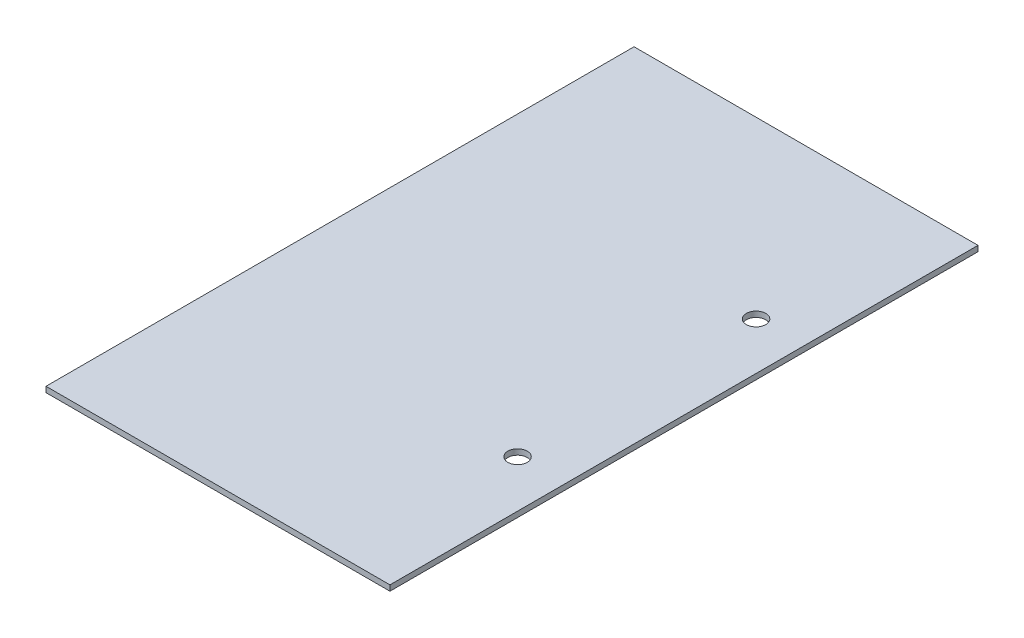
ISO-10303-21;
HEADER;
FILE_DESCRIPTION(('STEP AP214'),'2;1');
FILE_NAME('part.step','',(''),(''),'','','');
FILE_SCHEMA(('AUTOMOTIVE_DESIGN { 1 0 10303 214 1 1 1 1 }'));
ENDSEC;
DATA;
#1=APPLICATION_CONTEXT('core data for automotive mechanical design processes');
#2=APPLICATION_PROTOCOL_DEFINITION('international standard','automotive_design',2000,#1);
#3=PRODUCT_CONTEXT('',#1,'mechanical');
#4=PRODUCT('Part','Part','',(#3));
#5=PRODUCT_RELATED_PRODUCT_CATEGORY('part','',(#4));
#6=PRODUCT_DEFINITION_FORMATION('','',#4);
#7=PRODUCT_DEFINITION_CONTEXT('part definition',#1,'design');
#8=PRODUCT_DEFINITION('design','',#6,#7);
#9=PRODUCT_DEFINITION_SHAPE('','',#8);
#10=(LENGTH_UNIT() NAMED_UNIT(*) SI_UNIT(.MILLI.,.METRE.));
#11=(NAMED_UNIT(*) PLANE_ANGLE_UNIT() SI_UNIT($,.RADIAN.));
#12=(NAMED_UNIT(*) SI_UNIT($,.STERADIAN.) SOLID_ANGLE_UNIT());
#13=UNCERTAINTY_MEASURE_WITH_UNIT(LENGTH_MEASURE(1.E-05),#10,'distance_accuracy_value','');
#14=(GEOMETRIC_REPRESENTATION_CONTEXT(3) GLOBAL_UNCERTAINTY_ASSIGNED_CONTEXT((#13)) GLOBAL_UNIT_ASSIGNED_CONTEXT((#10,
#11,#12)) REPRESENTATION_CONTEXT('',''));
#15=CARTESIAN_POINT('',(0.,0.,0.));
#16=DIRECTION('',(0.,0.,1.));
#17=DIRECTION('',(1.,0.,0.));
#18=AXIS2_PLACEMENT_3D('',#15,#16,#17);
#19=CARTESIAN_POINT('',(0.,1.,0.));
#20=DIRECTION('',(0.,1.,0.));
#21=DIRECTION('',(0.,0.,1.));
#22=AXIS2_PLACEMENT_3D('',#19,#20,#21);
#23=PLANE('',#22);
#24=CARTESIAN_POINT('',(22.5,1.,21.5));
#25=DIRECTION('',(0.,1.,0.));
#26=DIRECTION('',(0.,0.,1.));
#27=AXIS2_PLACEMENT_3D('',#24,#25,#26);
#28=CIRCLE('',#27,1.75);
#29=CARTESIAN_POINT('',(22.5,1.,23.25));
#30=VERTEX_POINT('',#29);
#31=EDGE_CURVE('E116',#30,#30,#28,.T.);
#32=ORIENTED_EDGE('',*,*,#31,.F.);
#33=EDGE_LOOP('',(#32));
#34=FACE_BOUND('',#33,.T.);
#35=DIRECTION('',(0.,0.,-1.));
#36=VECTOR('',#35,1.);
#37=CARTESIAN_POINT('',(31.,1.,-53.));
#38=LINE('',#37,#36);
#39=CARTESIAN_POINT('',(31.,1.,53.));
#40=VERTEX_POINT('',#39);
#41=CARTESIAN_POINT('',(31.,1.,-53.));
#42=VERTEX_POINT('',#41);
#43=EDGE_CURVE('E93',#40,#42,#38,.T.);
#44=ORIENTED_EDGE('',*,*,#43,.T.);
#45=DIRECTION('',(-1.,0.,0.));
#46=VECTOR('',#45,1.);
#47=CARTESIAN_POINT('',(-31.,1.,-53.));
#48=LINE('',#47,#46);
#49=CARTESIAN_POINT('',(-31.,1.,-53.));
#50=VERTEX_POINT('',#49);
#51=EDGE_CURVE('E88',#42,#50,#48,.T.);
#52=ORIENTED_EDGE('',*,*,#51,.T.);
#53=DIRECTION('',(0.,0.,1.));
#54=VECTOR('',#53,1.);
#55=CARTESIAN_POINT('',(-31.,1.,-53.));
#56=LINE('',#55,#54);
#57=CARTESIAN_POINT('',(-31.,1.,53.));
#58=VERTEX_POINT('',#57);
#59=EDGE_CURVE('E91',#50,#58,#56,.T.);
#60=ORIENTED_EDGE('',*,*,#59,.T.);
#61=DIRECTION('',(1.,0.,0.));
#62=VECTOR('',#61,1.);
#63=CARTESIAN_POINT('',(-31.,1.,53.));
#64=LINE('',#63,#62);
#65=EDGE_CURVE('E57',#58,#40,#64,.T.);
#66=ORIENTED_EDGE('',*,*,#65,.T.);
#67=EDGE_LOOP('',(#44,#52,#60,#66));
#68=FACE_BOUND('',#67,.T.);
#69=CARTESIAN_POINT('',(22.5,1.,-21.5));
#70=DIRECTION('',(0.,1.,0.));
#71=DIRECTION('',(0.,0.,-1.));
#72=AXIS2_PLACEMENT_3D('',#69,#70,#71);
#73=CIRCLE('',#72,1.75);
#74=CARTESIAN_POINT('',(22.5,1.,-23.25));
#75=VERTEX_POINT('',#74);
#76=EDGE_CURVE('E150',#75,#75,#73,.T.);
#77=ORIENTED_EDGE('',*,*,#76,.F.);
#78=EDGE_LOOP('',(#77));
#79=FACE_BOUND('',#78,.T.);
#80=ADVANCED_FACE('F39',(#34,#68,#79),#23,.T.);
#81=CARTESIAN_POINT('',(0.,0.,0.));
#82=DIRECTION('',(0.,1.,0.));
#83=DIRECTION('',(0.,0.,1.));
#84=AXIS2_PLACEMENT_3D('',#81,#82,#83);
#85=PLANE('',#84);
#86=CARTESIAN_POINT('',(0.,0.,0.));
#87=DIRECTION('',(0.,1.,0.));
#88=DIRECTION('',(0.,0.,1.));
#89=AXIS2_PLACEMENT_3D('',#86,#87,#88);
#90=CIRCLE('',#89,5.);
#91=CARTESIAN_POINT('',(0.,0.,5.));
#92=VERTEX_POINT('',#91);
#93=EDGE_CURVE('E49',#92,#92,#90,.F.);
#94=ORIENTED_EDGE('',*,*,#93,.F.);
#95=EDGE_LOOP('',(#94));
#96=FACE_BOUND('',#95,.T.);
#97=DIRECTION('',(0.,0.,-1.));
#98=VECTOR('',#97,1.);
#99=CARTESIAN_POINT('',(31.,0.,-53.));
#100=LINE('',#99,#98);
#101=CARTESIAN_POINT('',(31.,0.,53.));
#102=VERTEX_POINT('',#101);
#103=CARTESIAN_POINT('',(31.,0.,-53.));
#104=VERTEX_POINT('',#103);
#105=EDGE_CURVE('E112',#102,#104,#100,.T.);
#106=ORIENTED_EDGE('',*,*,#105,.F.);
#107=DIRECTION('',(1.,0.,0.));
#108=VECTOR('',#107,1.);
#109=CARTESIAN_POINT('',(-31.,0.,53.));
#110=LINE('',#109,#108);
#111=CARTESIAN_POINT('',(-31.,0.,53.));
#112=VERTEX_POINT('',#111);
#113=EDGE_CURVE('E80',#112,#102,#110,.T.);
#114=ORIENTED_EDGE('',*,*,#113,.F.);
#115=DIRECTION('',(0.,0.,1.));
#116=VECTOR('',#115,1.);
#117=CARTESIAN_POINT('',(-31.,0.,-53.));
#118=LINE('',#117,#116);
#119=CARTESIAN_POINT('',(-31.,0.,-53.));
#120=VERTEX_POINT('',#119);
#121=EDGE_CURVE('E74',#120,#112,#118,.T.);
#122=ORIENTED_EDGE('',*,*,#121,.F.);
#123=DIRECTION('',(-1.,0.,0.));
#124=VECTOR('',#123,1.);
#125=CARTESIAN_POINT('',(-31.,0.,-53.));
#126=LINE('',#125,#124);
#127=EDGE_CURVE('E99',#104,#120,#126,.T.);
#128=ORIENTED_EDGE('',*,*,#127,.F.);
#129=EDGE_LOOP('',(#106,#114,#122,#128));
#130=FACE_BOUND('',#129,.T.);
#131=CARTESIAN_POINT('',(22.5,0.,21.5));
#132=DIRECTION('',(0.,1.,0.));
#133=DIRECTION('',(0.,0.,1.));
#134=AXIS2_PLACEMENT_3D('',#131,#132,#133);
#135=CIRCLE('',#134,1.75);
#136=CARTESIAN_POINT('',(22.5,0.,23.25));
#137=VERTEX_POINT('',#136);
#138=EDGE_CURVE('E144',#137,#137,#135,.T.);
#139=ORIENTED_EDGE('',*,*,#138,.T.);
#140=EDGE_LOOP('',(#139));
#141=FACE_BOUND('',#140,.T.);
#142=CARTESIAN_POINT('',(22.5,0.,-21.5));
#143=DIRECTION('',(0.,1.,0.));
#144=DIRECTION('',(0.,0.,-1.));
#145=AXIS2_PLACEMENT_3D('',#142,#143,#144);
#146=CIRCLE('',#145,1.75);
#147=CARTESIAN_POINT('',(22.5,0.,-23.25));
#148=VERTEX_POINT('',#147);
#149=EDGE_CURVE('E147',#148,#148,#146,.T.);
#150=ORIENTED_EDGE('',*,*,#149,.T.);
#151=EDGE_LOOP('',(#150));
#152=FACE_BOUND('',#151,.T.);
#153=ADVANCED_FACE('F134',(#96,#130,#141,#152),#85,.F.);
#154=CARTESIAN_POINT('',(31.,1.,-53.));
#155=DIRECTION('',(-1.,0.,0.));
#156=DIRECTION('',(0.,0.,1.));
#157=AXIS2_PLACEMENT_3D('',#154,#155,#156);
#158=PLANE('',#157);
#159=ORIENTED_EDGE('',*,*,#105,.T.);
#160=DIRECTION('',(0.,-1.,0.));
#161=VECTOR('',#160,1.);
#162=CARTESIAN_POINT('',(31.,1.,-53.));
#163=LINE('',#162,#161);
#164=EDGE_CURVE('E101',#42,#104,#163,.T.);
#165=ORIENTED_EDGE('',*,*,#164,.F.);
#166=ORIENTED_EDGE('',*,*,#43,.F.);
#167=DIRECTION('',(0.,-1.,0.));
#168=VECTOR('',#167,1.);
#169=CARTESIAN_POINT('',(31.,1.,53.));
#170=LINE('',#169,#168);
#171=EDGE_CURVE('E108',#40,#102,#170,.T.);
#172=ORIENTED_EDGE('',*,*,#171,.T.);
#173=EDGE_LOOP('',(#159,#165,#166,#172));
#174=FACE_BOUND('',#173,.T.);
#175=ADVANCED_FACE('F137',(#174),#158,.F.);
#176=CARTESIAN_POINT('',(-31.,1.,-53.));
#177=DIRECTION('',(0.,0.,1.));
#178=DIRECTION('',(1.,0.,0.));
#179=AXIS2_PLACEMENT_3D('',#176,#177,#178);
#180=PLANE('',#179);
#181=ORIENTED_EDGE('',*,*,#127,.T.);
#182=DIRECTION('',(0.,-1.,0.));
#183=VECTOR('',#182,1.);
#184=CARTESIAN_POINT('',(-31.,1.,-53.));
#185=LINE('',#184,#183);
#186=EDGE_CURVE('E97',#50,#120,#185,.T.);
#187=ORIENTED_EDGE('',*,*,#186,.F.);
#188=ORIENTED_EDGE('',*,*,#51,.F.);
#189=ORIENTED_EDGE('',*,*,#164,.T.);
#190=EDGE_LOOP('',(#181,#187,#188,#189));
#191=FACE_BOUND('',#190,.T.);
#192=ADVANCED_FACE('F98',(#191),#180,.F.);
#193=CARTESIAN_POINT('',(-31.,1.,-53.));
#194=DIRECTION('',(1.,0.,0.));
#195=DIRECTION('',(0.,0.,-1.));
#196=AXIS2_PLACEMENT_3D('',#193,#194,#195);
#197=PLANE('',#196);
#198=ORIENTED_EDGE('',*,*,#121,.T.);
#199=DIRECTION('',(0.,-1.,0.));
#200=VECTOR('',#199,1.);
#201=CARTESIAN_POINT('',(-31.,1.,53.));
#202=LINE('',#201,#200);
#203=EDGE_CURVE('E102',#58,#112,#202,.T.);
#204=ORIENTED_EDGE('',*,*,#203,.F.);
#205=ORIENTED_EDGE('',*,*,#59,.F.);
#206=ORIENTED_EDGE('',*,*,#186,.T.);
#207=EDGE_LOOP('',(#198,#204,#205,#206));
#208=FACE_BOUND('',#207,.T.);
#209=ADVANCED_FACE('F104',(#208),#197,.F.);
#210=CARTESIAN_POINT('',(-31.,1.,53.));
#211=DIRECTION('',(0.,0.,-1.));
#212=DIRECTION('',(-1.,0.,0.));
#213=AXIS2_PLACEMENT_3D('',#210,#211,#212);
#214=PLANE('',#213);
#215=ORIENTED_EDGE('',*,*,#113,.T.);
#216=ORIENTED_EDGE('',*,*,#171,.F.);
#217=ORIENTED_EDGE('',*,*,#65,.F.);
#218=ORIENTED_EDGE('',*,*,#203,.T.);
#219=EDGE_LOOP('',(#215,#216,#217,#218));
#220=FACE_BOUND('',#219,.T.);
#221=ADVANCED_FACE('F173',(#220),#214,.F.);
#222=CARTESIAN_POINT('',(22.5,1.,21.5));
#223=DIRECTION('',(0.,-1.,0.));
#224=DIRECTION('',(0.,0.,-1.));
#225=AXIS2_PLACEMENT_3D('',#222,#223,#224);
#226=CYLINDRICAL_SURFACE('',#225,1.75);
#227=ORIENTED_EDGE('',*,*,#31,.T.);
#228=EDGE_LOOP('',(#227));
#229=FACE_BOUND('',#228,.T.);
#230=ORIENTED_EDGE('',*,*,#138,.F.);
#231=EDGE_LOOP('',(#230));
#232=FACE_BOUND('',#231,.T.);
#233=ADVANCED_FACE('F163',(#229,#232),#226,.F.);
#234=CARTESIAN_POINT('',(22.5,1.,-21.5));
#235=DIRECTION('',(0.,-1.,0.));
#236=DIRECTION('',(0.,0.,-1.));
#237=AXIS2_PLACEMENT_3D('',#234,#235,#236);
#238=CYLINDRICAL_SURFACE('',#237,1.75);
#239=ORIENTED_EDGE('',*,*,#76,.T.);
#240=EDGE_LOOP('',(#239));
#241=FACE_BOUND('',#240,.T.);
#242=ORIENTED_EDGE('',*,*,#149,.F.);
#243=EDGE_LOOP('',(#242));
#244=FACE_BOUND('',#243,.T.);
#245=ADVANCED_FACE('F203',(#241,#244),#238,.F.);
#246=CARTESIAN_POINT('',(0.,-17.,0.));
#247=DIRECTION('',(0.,1.,0.));
#248=DIRECTION('',(0.,0.,1.));
#249=AXIS2_PLACEMENT_3D('',#246,#247,#248);
#250=CYLINDRICAL_SURFACE('',#249,5.);
#251=CARTESIAN_POINT('',(0.,-12.,0.));
#252=DIRECTION('',(0.,1.,0.));
#253=DIRECTION('',(0.,0.,1.));
#254=AXIS2_PLACEMENT_3D('',#251,#252,#253);
#255=CIRCLE('',#254,5.);
#256=CARTESIAN_POINT('',(0.,-12.,5.));
#257=VERTEX_POINT('',#256);
#258=EDGE_CURVE('E11',#257,#257,#255,.T.);
#259=ORIENTED_EDGE('',*,*,#258,.T.);
#260=EDGE_LOOP('',(#259));
#261=FACE_BOUND('',#260,.T.);
#262=ORIENTED_EDGE('',*,*,#93,.T.);
#263=EDGE_LOOP('',(#262));
#264=FACE_BOUND('',#263,.T.);
#265=ADVANCED_FACE('F132',(#261,#264),#250,.T.);
#266=CARTESIAN_POINT('',(0.,-12.,0.));
#267=DIRECTION('',(0.,-1.,0.));
#268=DIRECTION('',(0.,0.,-1.));
#269=AXIS2_PLACEMENT_3D('',#266,#267,#268);
#270=SPHERICAL_SURFACE('',#269,5.);
#271=ORIENTED_EDGE('',*,*,#258,.F.);
#272=EDGE_LOOP('',(#271));
#273=FACE_BOUND('',#272,.T.);
#274=ADVANCED_FACE('F41',(#273),#270,.T.);
#275=CLOSED_SHELL('',(#80,#153,#175,#192,#209,#221,#233,#245,#265,#274));
#276=MANIFOLD_SOLID_BREP('B2',#275);
#277=ADVANCED_BREP_SHAPE_REPRESENTATION('',(#18,#276),#14);
#278=SHAPE_DEFINITION_REPRESENTATION(#9,#277);
ENDSEC;
END-ISO-10303-21;
